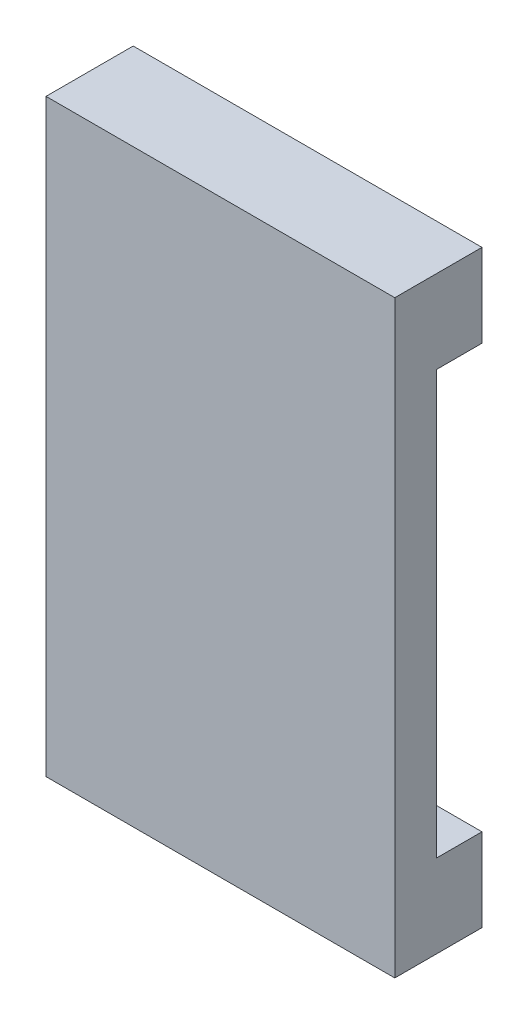
ISO-10303-21;
HEADER;
FILE_DESCRIPTION(('STEP AP214'),'2;1');
FILE_NAME('part.step','',(''),(''),'','','');
FILE_SCHEMA(('AUTOMOTIVE_DESIGN { 1 0 10303 214 1 1 1 1 }'));
ENDSEC;
DATA;
#1=APPLICATION_CONTEXT('core data for automotive mechanical design processes');
#2=APPLICATION_PROTOCOL_DEFINITION('international standard','automotive_design',2000,#1);
#3=PRODUCT_CONTEXT('',#1,'mechanical');
#4=PRODUCT('Part','Part','',(#3));
#5=PRODUCT_RELATED_PRODUCT_CATEGORY('part','',(#4));
#6=PRODUCT_DEFINITION_FORMATION('','',#4);
#7=PRODUCT_DEFINITION_CONTEXT('part definition',#1,'design');
#8=PRODUCT_DEFINITION('design','',#6,#7);
#9=PRODUCT_DEFINITION_SHAPE('','',#8);
#10=(LENGTH_UNIT() NAMED_UNIT(*) SI_UNIT(.MILLI.,.METRE.));
#11=(NAMED_UNIT(*) PLANE_ANGLE_UNIT() SI_UNIT($,.RADIAN.));
#12=(NAMED_UNIT(*) SI_UNIT($,.STERADIAN.) SOLID_ANGLE_UNIT());
#13=UNCERTAINTY_MEASURE_WITH_UNIT(LENGTH_MEASURE(1.E-05),#10,'distance_accuracy_value','');
#14=(GEOMETRIC_REPRESENTATION_CONTEXT(3) GLOBAL_UNCERTAINTY_ASSIGNED_CONTEXT((#13)) GLOBAL_UNIT_ASSIGNED_CONTEXT((#10,
#11,#12)) REPRESENTATION_CONTEXT('',''));
#15=CARTESIAN_POINT('',(0.,0.,0.));
#16=DIRECTION('',(0.,0.,1.));
#17=DIRECTION('',(1.,0.,0.));
#18=AXIS2_PLACEMENT_3D('',#15,#16,#17);
#19=CARTESIAN_POINT('',(0.,-35.435,5.5));
#20=DIRECTION('',(0.,1.,0.));
#21=DIRECTION('',(0.,0.,1.));
#22=AXIS2_PLACEMENT_3D('',#19,#20,#21);
#23=PLANE('',#22);
#24=DIRECTION('',(1.,0.,0.));
#25=VECTOR('',#24,1.);
#26=CARTESIAN_POINT('',(0.,-35.435,0.));
#27=LINE('',#26,#25);
#28=CARTESIAN_POINT('',(-26.,-35.435,0.));
#29=VERTEX_POINT('',#28);
#30=CARTESIAN_POINT('',(16.,-35.435,0.));
#31=VERTEX_POINT('',#30);
#32=EDGE_CURVE('E147',#29,#31,#27,.T.);
#33=ORIENTED_EDGE('',*,*,#32,.T.);
#34=DIRECTION('',(0.,0.,-1.));
#35=VECTOR('',#34,1.);
#36=CARTESIAN_POINT('',(16.,-35.435,5.5));
#37=LINE('',#36,#35);
#38=CARTESIAN_POINT('',(16.,-35.435,10.5));
#39=VERTEX_POINT('',#38);
#40=EDGE_CURVE('E11',#39,#31,#37,.T.);
#41=ORIENTED_EDGE('',*,*,#40,.F.);
#42=DIRECTION('',(1.,0.,0.));
#43=VECTOR('',#42,1.);
#44=CARTESIAN_POINT('',(-26.,-35.435,10.5));
#45=LINE('',#44,#43);
#46=CARTESIAN_POINT('',(-26.,-35.435,10.5));
#47=VERTEX_POINT('',#46);
#48=EDGE_CURVE('E127',#47,#39,#45,.T.);
#49=ORIENTED_EDGE('',*,*,#48,.F.);
#50=DIRECTION('',(0.,0.,-1.));
#51=VECTOR('',#50,1.);
#52=CARTESIAN_POINT('',(-26.,-35.435,5.5));
#53=LINE('',#52,#51);
#54=EDGE_CURVE('E99',#47,#29,#53,.T.);
#55=ORIENTED_EDGE('',*,*,#54,.T.);
#56=EDGE_LOOP('',(#33,#41,#49,#55));
#57=FACE_BOUND('',#56,.T.);
#58=ADVANCED_FACE('F45',(#57),#23,.F.);
#59=CARTESIAN_POINT('',(0.,-25.435,5.5));
#60=DIRECTION('',(0.,1.,0.));
#61=DIRECTION('',(0.,0.,1.));
#62=AXIS2_PLACEMENT_3D('',#59,#60,#61);
#63=PLANE('',#62);
#64=DIRECTION('',(1.,0.,0.));
#65=VECTOR('',#64,1.);
#66=CARTESIAN_POINT('',(0.,-25.435,0.));
#67=LINE('',#66,#65);
#68=CARTESIAN_POINT('',(-16.,-25.435,0.));
#69=VERTEX_POINT('',#68);
#70=CARTESIAN_POINT('',(16.,-25.435,0.));
#71=VERTEX_POINT('',#70);
#72=EDGE_CURVE('E163',#69,#71,#67,.T.);
#73=ORIENTED_EDGE('',*,*,#72,.F.);
#74=DIRECTION('',(0.,0.,-1.));
#75=VECTOR('',#74,1.);
#76=CARTESIAN_POINT('',(-16.,-25.435,5.5));
#77=LINE('',#76,#75);
#78=CARTESIAN_POINT('',(-16.,-25.435,5.5));
#79=VERTEX_POINT('',#78);
#80=EDGE_CURVE('E192',#79,#69,#77,.T.);
#81=ORIENTED_EDGE('',*,*,#80,.F.);
#82=DIRECTION('',(1.,0.,0.));
#83=VECTOR('',#82,1.);
#84=CARTESIAN_POINT('',(0.,-25.435,5.5));
#85=LINE('',#84,#83);
#86=CARTESIAN_POINT('',(16.,-25.435,5.5));
#87=VERTEX_POINT('',#86);
#88=EDGE_CURVE('E149',#79,#87,#85,.T.);
#89=ORIENTED_EDGE('',*,*,#88,.T.);
#90=DIRECTION('',(0.,0.,-1.));
#91=VECTOR('',#90,1.);
#92=CARTESIAN_POINT('',(16.,-25.435,5.5));
#93=LINE('',#92,#91);
#94=EDGE_CURVE('E54',#87,#71,#93,.T.);
#95=ORIENTED_EDGE('',*,*,#94,.T.);
#96=EDGE_LOOP('',(#73,#81,#89,#95));
#97=FACE_BOUND('',#96,.T.);
#98=ADVANCED_FACE('F197',(#97),#63,.T.);
#99=CARTESIAN_POINT('',(-16.,0.,5.5));
#100=DIRECTION('',(1.,0.,0.));
#101=DIRECTION('',(0.,1.,0.));
#102=AXIS2_PLACEMENT_3D('',#99,#100,#101);
#103=PLANE('',#102);
#104=DIRECTION('',(0.,-1.,0.));
#105=VECTOR('',#104,1.);
#106=CARTESIAN_POINT('',(-16.,0.,0.));
#107=LINE('',#106,#105);
#108=CARTESIAN_POINT('',(-16.,25.515,0.));
#109=VERTEX_POINT('',#108);
#110=EDGE_CURVE('E168',#109,#69,#107,.T.);
#111=ORIENTED_EDGE('',*,*,#110,.F.);
#112=DIRECTION('',(0.,0.,-1.));
#113=VECTOR('',#112,1.);
#114=CARTESIAN_POINT('',(-16.,25.515,5.5));
#115=LINE('',#114,#113);
#116=CARTESIAN_POINT('',(-16.,25.515,5.5));
#117=VERTEX_POINT('',#116);
#118=EDGE_CURVE('E62',#117,#109,#115,.T.);
#119=ORIENTED_EDGE('',*,*,#118,.F.);
#120=DIRECTION('',(0.,-1.,0.));
#121=VECTOR('',#120,1.);
#122=CARTESIAN_POINT('',(-16.,0.,5.5));
#123=LINE('',#122,#121);
#124=EDGE_CURVE('E152',#117,#79,#123,.T.);
#125=ORIENTED_EDGE('',*,*,#124,.T.);
#126=ORIENTED_EDGE('',*,*,#80,.T.);
#127=EDGE_LOOP('',(#111,#119,#125,#126));
#128=FACE_BOUND('',#127,.T.);
#129=ADVANCED_FACE('F206',(#128),#103,.T.);
#130=CARTESIAN_POINT('',(0.,25.515,5.5));
#131=DIRECTION('',(0.,1.,0.));
#132=DIRECTION('',(0.,0.,1.));
#133=AXIS2_PLACEMENT_3D('',#130,#131,#132);
#134=PLANE('',#133);
#135=DIRECTION('',(1.,0.,0.));
#136=VECTOR('',#135,1.);
#137=CARTESIAN_POINT('',(0.,25.515,0.));
#138=LINE('',#137,#136);
#139=CARTESIAN_POINT('',(16.,25.515,0.));
#140=VERTEX_POINT('',#139);
#141=EDGE_CURVE('E172',#109,#140,#138,.T.);
#142=ORIENTED_EDGE('',*,*,#141,.T.);
#143=DIRECTION('',(0.,0.,-1.));
#144=VECTOR('',#143,1.);
#145=CARTESIAN_POINT('',(16.,25.515,5.5));
#146=LINE('',#145,#144);
#147=CARTESIAN_POINT('',(16.,25.515,5.5));
#148=VERTEX_POINT('',#147);
#149=EDGE_CURVE('E186',#148,#140,#146,.T.);
#150=ORIENTED_EDGE('',*,*,#149,.F.);
#151=DIRECTION('',(1.,0.,0.));
#152=VECTOR('',#151,1.);
#153=CARTESIAN_POINT('',(0.,25.515,5.5));
#154=LINE('',#153,#152);
#155=EDGE_CURVE('E124',#117,#148,#154,.T.);
#156=ORIENTED_EDGE('',*,*,#155,.F.);
#157=ORIENTED_EDGE('',*,*,#118,.T.);
#158=EDGE_LOOP('',(#142,#150,#156,#157));
#159=FACE_BOUND('',#158,.T.);
#160=ADVANCED_FACE('F221',(#159),#134,.F.);
#161=CARTESIAN_POINT('',(16.,0.,5.5));
#162=DIRECTION('',(-1.,0.,0.));
#163=DIRECTION('',(0.,0.,1.));
#164=AXIS2_PLACEMENT_3D('',#161,#162,#163);
#165=PLANE('',#164);
#166=DIRECTION('',(0.,1.,0.));
#167=VECTOR('',#166,1.);
#168=CARTESIAN_POINT('',(16.,0.,0.));
#169=LINE('',#168,#167);
#170=CARTESIAN_POINT('',(16.,35.515,0.));
#171=VERTEX_POINT('',#170);
#172=EDGE_CURVE('E164',#140,#171,#169,.T.);
#173=ORIENTED_EDGE('',*,*,#172,.T.);
#174=DIRECTION('',(0.,0.,-1.));
#175=VECTOR('',#174,1.);
#176=CARTESIAN_POINT('',(16.,35.515,5.5));
#177=LINE('',#176,#175);
#178=CARTESIAN_POINT('',(16.,35.515,10.5));
#179=VERTEX_POINT('',#178);
#180=EDGE_CURVE('E183',#179,#171,#177,.T.);
#181=ORIENTED_EDGE('',*,*,#180,.F.);
#182=DIRECTION('',(0.,1.,0.));
#183=VECTOR('',#182,1.);
#184=CARTESIAN_POINT('',(16.,35.515,10.5));
#185=LINE('',#184,#183);
#186=EDGE_CURVE('E132',#39,#179,#185,.T.);
#187=ORIENTED_EDGE('',*,*,#186,.F.);
#188=ORIENTED_EDGE('',*,*,#40,.T.);
#189=EDGE_CURVE('E160',#31,#71,#169,.T.);
#190=ORIENTED_EDGE('',*,*,#189,.T.);
#191=ORIENTED_EDGE('',*,*,#94,.F.);
#192=DIRECTION('',(0.,1.,0.));
#193=VECTOR('',#192,1.);
#194=CARTESIAN_POINT('',(16.,35.515,5.5));
#195=LINE('',#194,#193);
#196=EDGE_CURVE('E139',#87,#148,#195,.T.);
#197=ORIENTED_EDGE('',*,*,#196,.T.);
#198=ORIENTED_EDGE('',*,*,#149,.T.);
#199=EDGE_LOOP('',(#173,#181,#187,#188,#190,#191,#197,#198));
#200=FACE_BOUND('',#199,.T.);
#201=ADVANCED_FACE('F201',(#200),#165,.F.);
#202=CARTESIAN_POINT('',(0.,35.515,5.5));
#203=DIRECTION('',(0.,1.,0.));
#204=DIRECTION('',(0.,0.,1.));
#205=AXIS2_PLACEMENT_3D('',#202,#203,#204);
#206=PLANE('',#205);
#207=DIRECTION('',(1.,0.,0.));
#208=VECTOR('',#207,1.);
#209=CARTESIAN_POINT('',(0.,35.515,0.));
#210=LINE('',#209,#208);
#211=CARTESIAN_POINT('',(-26.,35.515,0.));
#212=VERTEX_POINT('',#211);
#213=EDGE_CURVE('E175',#212,#171,#210,.T.);
#214=ORIENTED_EDGE('',*,*,#213,.F.);
#215=DIRECTION('',(0.,0.,-1.));
#216=VECTOR('',#215,1.);
#217=CARTESIAN_POINT('',(-26.,35.515,5.5));
#218=LINE('',#217,#216);
#219=CARTESIAN_POINT('',(-26.,35.515,10.5));
#220=VERTEX_POINT('',#219);
#221=EDGE_CURVE('E92',#220,#212,#218,.T.);
#222=ORIENTED_EDGE('',*,*,#221,.F.);
#223=DIRECTION('',(-1.,0.,0.));
#224=VECTOR('',#223,1.);
#225=CARTESIAN_POINT('',(-26.,35.515,10.5));
#226=LINE('',#225,#224);
#227=EDGE_CURVE('E137',#179,#220,#226,.T.);
#228=ORIENTED_EDGE('',*,*,#227,.F.);
#229=ORIENTED_EDGE('',*,*,#180,.T.);
#230=EDGE_LOOP('',(#214,#222,#228,#229));
#231=FACE_BOUND('',#230,.T.);
#232=ADVANCED_FACE('F213',(#231),#206,.T.);
#233=CARTESIAN_POINT('',(-26.,0.,5.5));
#234=DIRECTION('',(-1.,0.,0.));
#235=DIRECTION('',(0.,0.,1.));
#236=AXIS2_PLACEMENT_3D('',#233,#234,#235);
#237=PLANE('',#236);
#238=DIRECTION('',(0.,1.,0.));
#239=VECTOR('',#238,1.);
#240=CARTESIAN_POINT('',(-26.,0.,0.));
#241=LINE('',#240,#239);
#242=EDGE_CURVE('E122',#29,#212,#241,.T.);
#243=ORIENTED_EDGE('',*,*,#242,.F.);
#244=ORIENTED_EDGE('',*,*,#54,.F.);
#245=DIRECTION('',(0.,-1.,0.));
#246=VECTOR('',#245,1.);
#247=CARTESIAN_POINT('',(-26.,35.515,10.5));
#248=LINE('',#247,#246);
#249=EDGE_CURVE('E120',#220,#47,#248,.T.);
#250=ORIENTED_EDGE('',*,*,#249,.F.);
#251=ORIENTED_EDGE('',*,*,#221,.T.);
#252=EDGE_LOOP('',(#243,#244,#250,#251));
#253=FACE_BOUND('',#252,.T.);
#254=ADVANCED_FACE('F118',(#253),#237,.T.);
#255=CARTESIAN_POINT('',(0.,0.,0.));
#256=DIRECTION('',(0.,0.,1.));
#257=DIRECTION('',(1.,0.,0.));
#258=AXIS2_PLACEMENT_3D('',#255,#256,#257);
#259=PLANE('',#258);
#260=ORIENTED_EDGE('',*,*,#32,.F.);
#261=ORIENTED_EDGE('',*,*,#242,.T.);
#262=ORIENTED_EDGE('',*,*,#213,.T.);
#263=ORIENTED_EDGE('',*,*,#172,.F.);
#264=ORIENTED_EDGE('',*,*,#141,.F.);
#265=ORIENTED_EDGE('',*,*,#110,.T.);
#266=ORIENTED_EDGE('',*,*,#72,.T.);
#267=ORIENTED_EDGE('',*,*,#189,.F.);
#268=EDGE_LOOP('',(#260,#261,#262,#263,#264,#265,#266,#267));
#269=FACE_BOUND('',#268,.T.);
#270=ADVANCED_FACE('F203',(#269),#259,.F.);
#271=CARTESIAN_POINT('',(0.,0.,10.5));
#272=DIRECTION('',(0.,0.,1.));
#273=DIRECTION('',(1.,0.,0.));
#274=AXIS2_PLACEMENT_3D('',#271,#272,#273);
#275=PLANE('',#274);
#276=ORIENTED_EDGE('',*,*,#249,.T.);
#277=ORIENTED_EDGE('',*,*,#48,.T.);
#278=ORIENTED_EDGE('',*,*,#186,.T.);
#279=ORIENTED_EDGE('',*,*,#227,.T.);
#280=EDGE_LOOP('',(#276,#277,#278,#279));
#281=FACE_BOUND('',#280,.T.);
#282=ADVANCED_FACE('F135',(#281),#275,.T.);
#283=CARTESIAN_POINT('',(0.,0.,5.5));
#284=DIRECTION('',(0.,0.,1.));
#285=DIRECTION('',(1.,0.,0.));
#286=AXIS2_PLACEMENT_3D('',#283,#284,#285);
#287=PLANE('',#286);
#288=ORIENTED_EDGE('',*,*,#88,.F.);
#289=ORIENTED_EDGE('',*,*,#124,.F.);
#290=ORIENTED_EDGE('',*,*,#155,.T.);
#291=ORIENTED_EDGE('',*,*,#196,.F.);
#292=EDGE_LOOP('',(#288,#289,#290,#291));
#293=FACE_BOUND('',#292,.T.);
#294=ADVANCED_FACE('F209',(#293),#287,.F.);
#295=CLOSED_SHELL('',(#58,#98,#129,#160,#201,#232,#254,#270,#282,#294));
#296=MANIFOLD_SOLID_BREP('B2',#295);
#297=ADVANCED_BREP_SHAPE_REPRESENTATION('',(#18,#296),#14);
#298=SHAPE_DEFINITION_REPRESENTATION(#9,#297);
ENDSEC;
END-ISO-10303-21;
